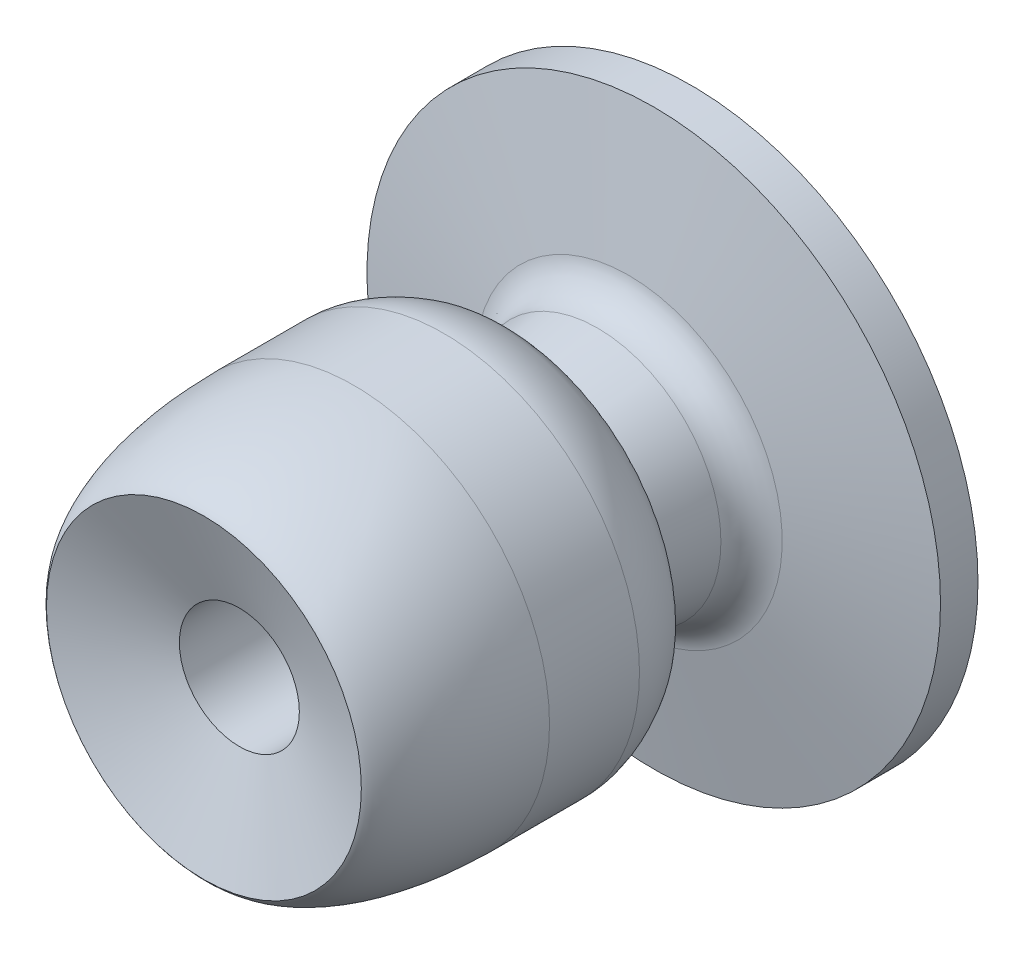
ISO-10303-21;
HEADER;
FILE_DESCRIPTION(('STEP AP214'),'2;1');
FILE_NAME('part.step','',(''),(''),'','','');
FILE_SCHEMA(('AUTOMOTIVE_DESIGN { 1 0 10303 214 1 1 1 1 }'));
ENDSEC;
DATA;
#1=APPLICATION_CONTEXT('core data for automotive mechanical design processes');
#2=APPLICATION_PROTOCOL_DEFINITION('international standard','automotive_design',2000,#1);
#3=PRODUCT_CONTEXT('',#1,'mechanical');
#4=PRODUCT('Part','Part','',(#3));
#5=PRODUCT_RELATED_PRODUCT_CATEGORY('part','',(#4));
#6=PRODUCT_DEFINITION_FORMATION('','',#4);
#7=PRODUCT_DEFINITION_CONTEXT('part definition',#1,'design');
#8=PRODUCT_DEFINITION('design','',#6,#7);
#9=PRODUCT_DEFINITION_SHAPE('','',#8);
#10=(LENGTH_UNIT() NAMED_UNIT(*) SI_UNIT(.MILLI.,.METRE.));
#11=(NAMED_UNIT(*) PLANE_ANGLE_UNIT() SI_UNIT($,.RADIAN.));
#12=(NAMED_UNIT(*) SI_UNIT($,.STERADIAN.) SOLID_ANGLE_UNIT());
#13=UNCERTAINTY_MEASURE_WITH_UNIT(LENGTH_MEASURE(1.E-05),#10,'distance_accuracy_value','');
#14=(GEOMETRIC_REPRESENTATION_CONTEXT(3) GLOBAL_UNCERTAINTY_ASSIGNED_CONTEXT((#13)) GLOBAL_UNIT_ASSIGNED_CONTEXT((#10,
#11,#12)) REPRESENTATION_CONTEXT('',''));
#15=CARTESIAN_POINT('',(0.,0.,0.));
#16=DIRECTION('',(0.,0.,1.));
#17=DIRECTION('',(1.,0.,0.));
#18=AXIS2_PLACEMENT_3D('',#15,#16,#17);
#19=CARTESIAN_POINT('',(0.,0.,0.));
#20=DIRECTION('',(0.,0.,1.));
#21=DIRECTION('',(1.,0.,0.));
#22=AXIS2_PLACEMENT_3D('',#19,#20,#21);
#23=PLANE('',#22);
#24=CARTESIAN_POINT('',(0.,0.,0.));
#25=DIRECTION('',(0.,0.,1.));
#26=DIRECTION('',(1.,0.,0.));
#27=AXIS2_PLACEMENT_3D('',#24,#25,#26);
#28=CIRCLE('',#27,38.25);
#29=CARTESIAN_POINT('',(38.25,0.,0.));
#30=VERTEX_POINT('',#29);
#31=EDGE_CURVE('E143',#30,#30,#28,.T.);
#32=ORIENTED_EDGE('',*,*,#31,.F.);
#33=EDGE_LOOP('',(#32));
#34=FACE_BOUND('',#33,.T.);
#35=DIRECTION('',(0.,-1.,0.));
#36=VECTOR('',#35,1.);
#37=CARTESIAN_POINT('',(10.,-10.,0.));
#38=LINE('',#37,#36);
#39=CARTESIAN_POINT('',(10.,10.,0.));
#40=VERTEX_POINT('',#39);
#41=CARTESIAN_POINT('',(10.,-10.,0.));
#42=VERTEX_POINT('',#41);
#43=EDGE_CURVE('E94',#40,#42,#38,.T.);
#44=ORIENTED_EDGE('',*,*,#43,.F.);
#45=DIRECTION('',(1.,0.,0.));
#46=VECTOR('',#45,1.);
#47=CARTESIAN_POINT('',(-10.,10.,0.));
#48=LINE('',#47,#46);
#49=CARTESIAN_POINT('',(-10.,10.,0.));
#50=VERTEX_POINT('',#49);
#51=EDGE_CURVE('E91',#50,#40,#48,.T.);
#52=ORIENTED_EDGE('',*,*,#51,.F.);
#53=DIRECTION('',(0.,1.,0.));
#54=VECTOR('',#53,1.);
#55=CARTESIAN_POINT('',(-10.,-10.,0.));
#56=LINE('',#55,#54);
#57=CARTESIAN_POINT('',(-10.,-10.,0.));
#58=VERTEX_POINT('',#57);
#59=EDGE_CURVE('E53',#58,#50,#56,.T.);
#60=ORIENTED_EDGE('',*,*,#59,.F.);
#61=DIRECTION('',(-1.,0.,0.));
#62=VECTOR('',#61,1.);
#63=CARTESIAN_POINT('',(-10.,-10.,0.));
#64=LINE('',#63,#62);
#65=EDGE_CURVE('E48',#42,#58,#64,.T.);
#66=ORIENTED_EDGE('',*,*,#65,.F.);
#67=EDGE_LOOP('',(#44,#52,#60,#66));
#68=FACE_BOUND('',#67,.T.);
#69=ADVANCED_FACE('F32',(#34,#68),#23,.F.);
#70=CARTESIAN_POINT('',(0.,0.,5.));
#71=DIRECTION('',(0.,0.,-1.));
#72=DIRECTION('',(-1.,0.,0.));
#73=AXIS2_PLACEMENT_3D('',#70,#71,#72);
#74=CYLINDRICAL_SURFACE('',#73,38.25);
#75=CARTESIAN_POINT('',(0.,0.,5.));
#76=DIRECTION('',(0.,0.,1.));
#77=DIRECTION('',(1.,0.,0.));
#78=AXIS2_PLACEMENT_3D('',#75,#76,#77);
#79=CIRCLE('',#78,38.25);
#80=CARTESIAN_POINT('',(38.25,0.,5.));
#81=VERTEX_POINT('',#80);
#82=EDGE_CURVE('E140',#81,#81,#79,.T.);
#83=ORIENTED_EDGE('',*,*,#82,.F.);
#84=EDGE_LOOP('',(#83));
#85=FACE_BOUND('',#84,.T.);
#86=ORIENTED_EDGE('',*,*,#31,.T.);
#87=EDGE_LOOP('',(#86));
#88=FACE_BOUND('',#87,.T.);
#89=ADVANCED_FACE('F129',(#85,#88),#74,.T.);
#90=CARTESIAN_POINT('',(0.,0.,9.));
#91=DIRECTION('',(0.,0.,-1.));
#92=DIRECTION('',(0.,1.,0.));
#93=AXIS2_PLACEMENT_3D('',#90,#91,#92);
#94=CONICAL_SURFACE('',#93,17.,0.152649328395265);
#95=CARTESIAN_POINT('',(0.,0.,12.4986093370403));
#96=DIRECTION('',(0.,0.,-1.));
#97=DIRECTION('',(0.,1.,0.));
#98=AXIS2_PLACEMENT_3D('',#95,#96,#97);
#99=CIRCLE('',#98,16.4617524096861);
#100=CARTESIAN_POINT('',(0.,16.4617524096861,12.4986093370403));
#101=VERTEX_POINT('',#100);
#102=EDGE_CURVE('E11',#101,#101,#99,.F.);
#103=ORIENTED_EDGE('',*,*,#102,.T.);
#104=EDGE_LOOP('',(#103));
#105=FACE_BOUND('',#104,.T.);
#106=CARTESIAN_POINT('',(0.,0.,22.));
#107=DIRECTION('',(0.,0.,-1.));
#108=DIRECTION('',(-1.,0.,0.));
#109=AXIS2_PLACEMENT_3D('',#106,#107,#108);
#110=CIRCLE('',#109,15.);
#111=CARTESIAN_POINT('',(-15.,0.,22.));
#112=VERTEX_POINT('',#111);
#113=EDGE_CURVE('E163',#112,#112,#110,.T.);
#114=ORIENTED_EDGE('',*,*,#113,.T.);
#115=EDGE_LOOP('',(#114));
#116=FACE_BOUND('',#115,.T.);
#117=ADVANCED_FACE('F125',(#105,#116),#94,.T.);
#118=CARTESIAN_POINT('',(0.,0.,5.));
#119=DIRECTION('',(0.,0.,-1.));
#120=DIRECTION('',(0.,1.,0.));
#121=AXIS2_PLACEMENT_3D('',#118,#119,#120);
#122=CONICAL_SURFACE('',#121,38.25,1.38473814964589);
#123=CARTESIAN_POINT('',(0.,0.,8.34518999664886));
#124=DIRECTION('',(0.,0.,-1.));
#125=DIRECTION('',(0.,1.,0.));
#126=AXIS2_PLACEMENT_3D('',#123,#124,#125);
#127=CIRCLE('',#126,20.478678142803);
#128=CARTESIAN_POINT('',(0.,20.478678142803,8.34518999664887));
#129=VERTEX_POINT('',#128);
#130=EDGE_CURVE('E41',#129,#129,#127,.T.);
#131=ORIENTED_EDGE('',*,*,#130,.T.);
#132=EDGE_LOOP('',(#131));
#133=FACE_BOUND('',#132,.T.);
#134=ORIENTED_EDGE('',*,*,#82,.T.);
#135=EDGE_LOOP('',(#134));
#136=FACE_BOUND('',#135,.T.);
#137=ADVANCED_FACE('F122',(#133,#136),#122,.T.);
#138=CARTESIAN_POINT('',(0.,0.,13.25889525831));
#139=DIRECTION('',(0.,0.,-1.));
#140=DIRECTION('',(0.,1.,0.));
#141=AXIS2_PLACEMENT_3D('',#138,#139,#140);
#142=TOROIDAL_SURFACE('',#141,21.4036108979392,5.);
#143=ORIENTED_EDGE('',*,*,#102,.F.);
#144=EDGE_LOOP('',(#143));
#145=FACE_BOUND('',#144,.T.);
#146=ORIENTED_EDGE('',*,*,#130,.F.);
#147=EDGE_LOOP('',(#146));
#148=FACE_BOUND('',#147,.T.);
#149=ADVANCED_FACE('F34',(#145,#148),#142,.F.);
#150=CARTESIAN_POINT('',(0.,26.1,45.));
#151=CARTESIAN_POINT('',(0.,26.0039697109823,57.8462022827947));
#152=CARTESIAN_POINT('',(0.,22.2940626244741,64.2302992532997));
#153=CARTESIAN_POINT('',(0.,21.,65.));
#154=B_SPLINE_CURVE_WITH_KNOTS('',3,(#150,#151,#152,#153),.UNSPECIFIED.,.F.,.F.,(4,4),(0.,1.),.UNSPECIFIED.);
#155=CARTESIAN_POINT('',(0.,0.,0.));
#156=DIRECTION('',(0.,0.,-1.));
#157=AXIS1_PLACEMENT('',#155,#156);
#158=SURFACE_OF_REVOLUTION('',#154,#157);
#159=CARTESIAN_POINT('',(0.,0.,65.));
#160=DIRECTION('',(0.,0.,-1.));
#161=DIRECTION('',(-1.,0.,0.));
#162=AXIS2_PLACEMENT_3D('',#159,#160,#161);
#163=CIRCLE('',#162,21.);
#164=CARTESIAN_POINT('',(-21.,0.,65.));
#165=VERTEX_POINT('',#164);
#166=EDGE_CURVE('E165',#165,#165,#163,.T.);
#167=ORIENTED_EDGE('',*,*,#166,.T.);
#168=EDGE_LOOP('',(#167));
#169=FACE_BOUND('',#168,.T.);
#170=CARTESIAN_POINT('',(0.,0.,45.));
#171=DIRECTION('',(0.,0.,-1.));
#172=DIRECTION('',(-1.,0.,0.));
#173=AXIS2_PLACEMENT_3D('',#170,#171,#172);
#174=CIRCLE('',#173,26.1);
#175=CARTESIAN_POINT('',(-26.1,0.,45.));
#176=VERTEX_POINT('',#175);
#177=EDGE_CURVE('E144',#176,#176,#174,.T.);
#178=ORIENTED_EDGE('',*,*,#177,.F.);
#179=EDGE_LOOP('',(#178));
#180=FACE_BOUND('',#179,.T.);
#181=ADVANCED_FACE('F115',(#169,#180),#158,.F.);
#182=CARTESIAN_POINT('',(0.,0.,0.));
#183=DIRECTION('',(0.,0.,-1.));
#184=DIRECTION('',(-1.,0.,0.));
#185=AXIS2_PLACEMENT_3D('',#182,#183,#184);
#186=CYLINDRICAL_SURFACE('',#185,26.1);
#187=ORIENTED_EDGE('',*,*,#177,.T.);
#188=EDGE_LOOP('',(#187));
#189=FACE_BOUND('',#188,.T.);
#190=CARTESIAN_POINT('',(0.,0.,33.));
#191=DIRECTION('',(0.,0.,-1.));
#192=DIRECTION('',(-1.,0.,0.));
#193=AXIS2_PLACEMENT_3D('',#190,#191,#192);
#194=CIRCLE('',#193,26.1);
#195=CARTESIAN_POINT('',(-26.1,0.,33.));
#196=VERTEX_POINT('',#195);
#197=EDGE_CURVE('E148',#196,#196,#194,.T.);
#198=ORIENTED_EDGE('',*,*,#197,.F.);
#199=EDGE_LOOP('',(#198));
#200=FACE_BOUND('',#199,.T.);
#201=ADVANCED_FACE('F119',(#189,#200),#186,.T.);
#202=CARTESIAN_POINT('',(0.,14.9999999999999,22.));
#203=CARTESIAN_POINT('',(0.,20.9501939444344,22.4707122979045));
#204=CARTESIAN_POINT('',(0.,23.5579746873832,25.6224965914612));
#205=CARTESIAN_POINT('',(0.,24.254113599142,26.8207683111497));
#206=CARTESIAN_POINT('',(0.,26.1,30.0101382726864));
#207=CARTESIAN_POINT('',(0.,26.1,33.));
#208=B_SPLINE_CURVE_WITH_KNOTS('',3,(#202,#203,#204,#205,#206,#207),.UNSPECIFIED.,.F.,.F.,(4,1,
1,4),(0.,0.43667555768994,0.53667555768994,1.),.UNSPECIFIED.);
#209=CARTESIAN_POINT('',(0.,0.,0.));
#210=DIRECTION('',(0.,0.,-1.));
#211=AXIS1_PLACEMENT('',#209,#210);
#212=SURFACE_OF_REVOLUTION('',#208,#211);
#213=ORIENTED_EDGE('',*,*,#197,.T.);
#214=EDGE_LOOP('',(#213));
#215=FACE_BOUND('',#214,.T.);
#216=ORIENTED_EDGE('',*,*,#113,.F.);
#217=EDGE_LOOP('',(#216));
#218=FACE_BOUND('',#217,.T.);
#219=ADVANCED_FACE('F180',(#215,#218),#212,.F.);
#220=CARTESIAN_POINT('',(0.,0.,65.));
#221=DIRECTION('',(0.,0.,1.));
#222=DIRECTION('',(1.,0.,0.));
#223=AXIS2_PLACEMENT_3D('',#220,#221,#222);
#224=CONICAL_SURFACE('',#223,21.,1.22173047639604);
#225=CARTESIAN_POINT('',(0.,0.,60.2683869545395));
#226=DIRECTION('',(0.,0.,1.));
#227=DIRECTION('',(1.,0.,0.));
#228=AXIS2_PLACEMENT_3D('',#225,#226,#227);
#229=CIRCLE('',#228,8.);
#230=CARTESIAN_POINT('',(8.,0.,60.2683869545395));
#231=VERTEX_POINT('',#230);
#232=EDGE_CURVE('E36',#231,#231,#229,.T.);
#233=ORIENTED_EDGE('',*,*,#232,.F.);
#234=EDGE_LOOP('',(#233));
#235=FACE_BOUND('',#234,.T.);
#236=ORIENTED_EDGE('',*,*,#166,.F.);
#237=EDGE_LOOP('',(#236));
#238=FACE_BOUND('',#237,.T.);
#239=ADVANCED_FACE('F177',(#235,#238),#224,.F.);
#240=CARTESIAN_POINT('',(0.,0.,65.));
#241=DIRECTION('',(0.,0.,-1.));
#242=DIRECTION('',(-1.,0.,0.));
#243=AXIS2_PLACEMENT_3D('',#240,#241,#242);
#244=CYLINDRICAL_SURFACE('',#243,8.);
#245=ORIENTED_EDGE('',*,*,#232,.T.);
#246=EDGE_LOOP('',(#245));
#247=FACE_BOUND('',#246,.T.);
#248=CARTESIAN_POINT('',(0.,0.,0.));
#249=DIRECTION('',(0.,0.,-1.));
#250=DIRECTION('',(-1.,0.,0.));
#251=AXIS2_PLACEMENT_3D('',#248,#249,#250);
#252=CIRCLE('',#251,8.);
#253=CARTESIAN_POINT('',(-8.,0.,0.));
#254=VERTEX_POINT('',#253);
#255=EDGE_CURVE('E95',#254,#254,#252,.F.);
#256=ORIENTED_EDGE('',*,*,#255,.F.);
#257=EDGE_LOOP('',(#256));
#258=FACE_BOUND('',#257,.T.);
#259=ADVANCED_FACE('F174',(#247,#258),#244,.F.);
#260=CARTESIAN_POINT('',(0.,0.,0.));
#261=DIRECTION('',(0.,0.,-1.));
#262=DIRECTION('',(-1.,0.,0.));
#263=AXIS2_PLACEMENT_3D('',#260,#261,#262);
#264=PLANE('',#263);
#265=ORIENTED_EDGE('',*,*,#255,.T.);
#266=EDGE_LOOP('',(#265));
#267=FACE_BOUND('',#266,.T.);
#268=ADVANCED_FACE('F186',(#267),#264,.F.);
#269=CARTESIAN_POINT('',(10.,-10.,-10.));
#270=DIRECTION('',(-1.,0.,0.));
#271=DIRECTION('',(0.,0.,1.));
#272=AXIS2_PLACEMENT_3D('',#269,#270,#271);
#273=PLANE('',#272);
#274=ORIENTED_EDGE('',*,*,#43,.T.);
#275=DIRECTION('',(0.,0.,1.));
#276=VECTOR('',#275,1.);
#277=CARTESIAN_POINT('',(10.,-10.,-10.));
#278=LINE('',#277,#276);
#279=CARTESIAN_POINT('',(10.,-10.,-10.));
#280=VERTEX_POINT('',#279);
#281=EDGE_CURVE('E75',#280,#42,#278,.T.);
#282=ORIENTED_EDGE('',*,*,#281,.F.);
#283=DIRECTION('',(0.,-1.,0.));
#284=VECTOR('',#283,1.);
#285=CARTESIAN_POINT('',(10.,-10.,-10.));
#286=LINE('',#285,#284);
#287=CARTESIAN_POINT('',(10.,10.,-10.));
#288=VERTEX_POINT('',#287);
#289=EDGE_CURVE('E82',#288,#280,#286,.T.);
#290=ORIENTED_EDGE('',*,*,#289,.F.);
#291=DIRECTION('',(0.,0.,1.));
#292=VECTOR('',#291,1.);
#293=CARTESIAN_POINT('',(10.,10.,-10.));
#294=LINE('',#293,#292);
#295=EDGE_CURVE('E305',#288,#40,#294,.T.);
#296=ORIENTED_EDGE('',*,*,#295,.T.);
#297=EDGE_LOOP('',(#274,#282,#290,#296));
#298=FACE_BOUND('',#297,.T.);
#299=ADVANCED_FACE('F93',(#298),#273,.F.);
#300=CARTESIAN_POINT('',(-10.,-10.,-10.));
#301=DIRECTION('',(0.,1.,0.));
#302=DIRECTION('',(-1.,0.,0.));
#303=AXIS2_PLACEMENT_3D('',#300,#301,#302);
#304=PLANE('',#303);
#305=ORIENTED_EDGE('',*,*,#65,.T.);
#306=DIRECTION('',(0.,0.,1.));
#307=VECTOR('',#306,1.);
#308=CARTESIAN_POINT('',(-10.,-10.,-10.));
#309=LINE('',#308,#307);
#310=CARTESIAN_POINT('',(-10.,-10.,-10.));
#311=VERTEX_POINT('',#310);
#312=EDGE_CURVE('E78',#311,#58,#309,.T.);
#313=ORIENTED_EDGE('',*,*,#312,.F.);
#314=DIRECTION('',(-1.,0.,0.));
#315=VECTOR('',#314,1.);
#316=CARTESIAN_POINT('',(-10.,-10.,-10.));
#317=LINE('',#316,#315);
#318=EDGE_CURVE('E71',#280,#311,#317,.T.);
#319=ORIENTED_EDGE('',*,*,#318,.F.);
#320=ORIENTED_EDGE('',*,*,#281,.T.);
#321=EDGE_LOOP('',(#305,#313,#319,#320));
#322=FACE_BOUND('',#321,.T.);
#323=ADVANCED_FACE('F73',(#322),#304,.F.);
#324=CARTESIAN_POINT('',(-10.,-10.,-10.));
#325=DIRECTION('',(1.,0.,0.));
#326=DIRECTION('',(0.,0.,-1.));
#327=AXIS2_PLACEMENT_3D('',#324,#325,#326);
#328=PLANE('',#327);
#329=ORIENTED_EDGE('',*,*,#59,.T.);
#330=DIRECTION('',(0.,0.,1.));
#331=VECTOR('',#330,1.);
#332=CARTESIAN_POINT('',(-10.,10.,-10.));
#333=LINE('',#332,#331);
#334=CARTESIAN_POINT('',(-10.,10.,-10.));
#335=VERTEX_POINT('',#334);
#336=EDGE_CURVE('E99',#335,#50,#333,.T.);
#337=ORIENTED_EDGE('',*,*,#336,.F.);
#338=DIRECTION('',(0.,1.,0.));
#339=VECTOR('',#338,1.);
#340=CARTESIAN_POINT('',(-10.,-10.,-10.));
#341=LINE('',#340,#339);
#342=EDGE_CURVE('E81',#311,#335,#341,.T.);
#343=ORIENTED_EDGE('',*,*,#342,.F.);
#344=ORIENTED_EDGE('',*,*,#312,.T.);
#345=EDGE_LOOP('',(#329,#337,#343,#344));
#346=FACE_BOUND('',#345,.T.);
#347=ADVANCED_FACE('F194',(#346),#328,.F.);
#348=CARTESIAN_POINT('',(-10.,10.,-10.));
#349=DIRECTION('',(0.,-1.,0.));
#350=DIRECTION('',(1.,0.,0.));
#351=AXIS2_PLACEMENT_3D('',#348,#349,#350);
#352=PLANE('',#351);
#353=ORIENTED_EDGE('',*,*,#51,.T.);
#354=ORIENTED_EDGE('',*,*,#295,.F.);
#355=DIRECTION('',(1.,0.,0.));
#356=VECTOR('',#355,1.);
#357=CARTESIAN_POINT('',(-10.,10.,-10.));
#358=LINE('',#357,#356);
#359=EDGE_CURVE('E87',#335,#288,#358,.T.);
#360=ORIENTED_EDGE('',*,*,#359,.F.);
#361=ORIENTED_EDGE('',*,*,#336,.T.);
#362=EDGE_LOOP('',(#353,#354,#360,#361));
#363=FACE_BOUND('',#362,.T.);
#364=ADVANCED_FACE('F197',(#363),#352,.F.);
#365=CARTESIAN_POINT('',(0.,0.,-10.));
#366=DIRECTION('',(0.,0.,-1.));
#367=DIRECTION('',(-1.,0.,0.));
#368=AXIS2_PLACEMENT_3D('',#365,#366,#367);
#369=PLANE('',#368);
#370=ORIENTED_EDGE('',*,*,#289,.T.);
#371=ORIENTED_EDGE('',*,*,#318,.T.);
#372=ORIENTED_EDGE('',*,*,#342,.T.);
#373=ORIENTED_EDGE('',*,*,#359,.T.);
#374=EDGE_LOOP('',(#370,#371,#372,#373));
#375=FACE_BOUND('',#374,.T.);
#376=ADVANCED_FACE('F85',(#375),#369,.T.);
#377=CLOSED_SHELL('',(#69,#89,#117,#137,#149,#181,#201,#219,#239,#259,#268,#299,#323,#347,#364,#376));
#378=MANIFOLD_SOLID_BREP('B2',#377);
#379=ADVANCED_BREP_SHAPE_REPRESENTATION('',(#18,#378),#14);
#380=SHAPE_DEFINITION_REPRESENTATION(#9,#379);
ENDSEC;
END-ISO-10303-21;
